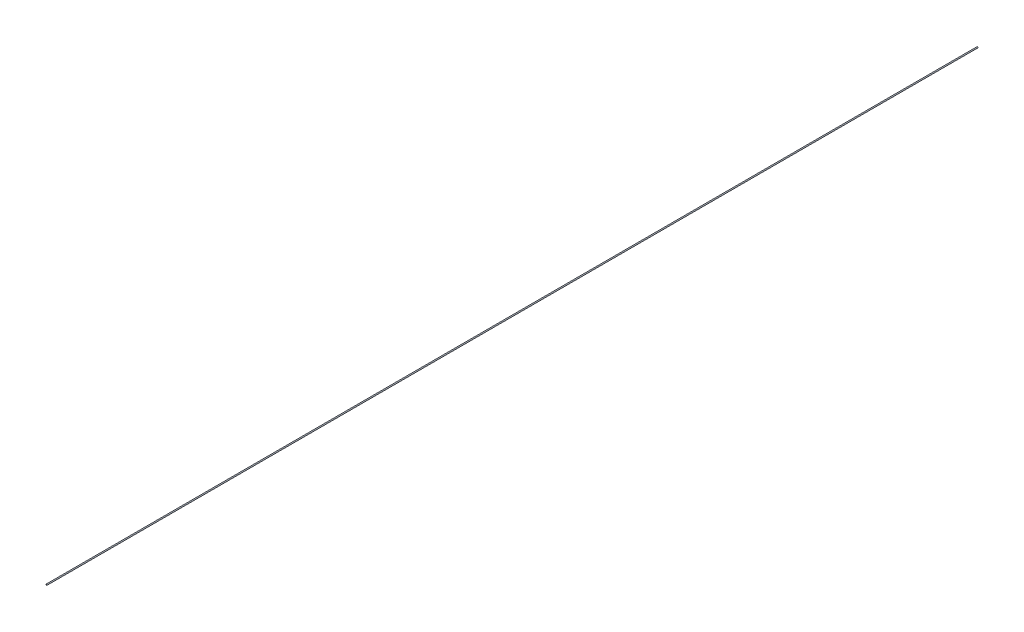
ISO-10303-21;
HEADER;
FILE_DESCRIPTION(('STEP AP214'),'2;1');
FILE_NAME('part.step','',(''),(''),'','','');
FILE_SCHEMA(('AUTOMOTIVE_DESIGN { 1 0 10303 214 1 1 1 1 }'));
ENDSEC;
DATA;
#1=APPLICATION_CONTEXT('core data for automotive mechanical design processes');
#2=APPLICATION_PROTOCOL_DEFINITION('international standard','automotive_design',2000,#1);
#3=PRODUCT_CONTEXT('',#1,'mechanical');
#4=PRODUCT('Part','Part','',(#3));
#5=PRODUCT_RELATED_PRODUCT_CATEGORY('part','',(#4));
#6=PRODUCT_DEFINITION_FORMATION('','',#4);
#7=PRODUCT_DEFINITION_CONTEXT('part definition',#1,'design');
#8=PRODUCT_DEFINITION('design','',#6,#7);
#9=PRODUCT_DEFINITION_SHAPE('','',#8);
#10=(LENGTH_UNIT() NAMED_UNIT(*) SI_UNIT(.MILLI.,.METRE.));
#11=(NAMED_UNIT(*) PLANE_ANGLE_UNIT() SI_UNIT($,.RADIAN.));
#12=(NAMED_UNIT(*) SI_UNIT($,.STERADIAN.) SOLID_ANGLE_UNIT());
#13=UNCERTAINTY_MEASURE_WITH_UNIT(LENGTH_MEASURE(1.E-05),#10,'distance_accuracy_value','');
#14=(GEOMETRIC_REPRESENTATION_CONTEXT(3) GLOBAL_UNCERTAINTY_ASSIGNED_CONTEXT((#13)) GLOBAL_UNIT_ASSIGNED_CONTEXT((#10,
#11,#12)) REPRESENTATION_CONTEXT('',''));
#15=CARTESIAN_POINT('',(0.,0.,0.));
#16=DIRECTION('',(0.,0.,1.));
#17=DIRECTION('',(1.,0.,0.));
#18=AXIS2_PLACEMENT_3D('',#15,#16,#17);
#19=CARTESIAN_POINT('',(0.,0.,11125.2));
#20=DIRECTION('',(0.,0.,1.));
#21=DIRECTION('',(1.,0.,0.));
#22=AXIS2_PLACEMENT_3D('',#19,#20,#21);
#23=PLANE('',#22);
#24=CARTESIAN_POINT('',(0.,0.,11125.2));
#25=DIRECTION('',(0.,0.,1.));
#26=DIRECTION('',(1.,0.,0.));
#27=AXIS2_PLACEMENT_3D('',#24,#25,#26);
#28=CIRCLE('',#27,6.35);
#29=CARTESIAN_POINT('',(6.35,0.,11125.2));
#30=VERTEX_POINT('',#29);
#31=EDGE_CURVE('E10',#30,#30,#28,.T.);
#32=ORIENTED_EDGE('',*,*,#31,.T.);
#33=EDGE_LOOP('',(#32));
#34=FACE_BOUND('',#33,.T.);
#35=CARTESIAN_POINT('',(0.,0.,11125.2));
#36=DIRECTION('',(0.,0.,1.));
#37=DIRECTION('',(1.,0.,0.));
#38=AXIS2_PLACEMENT_3D('',#35,#36,#37);
#39=CIRCLE('',#38,5.334);
#40=CARTESIAN_POINT('',(5.334,0.,11125.2));
#41=VERTEX_POINT('',#40);
#42=EDGE_CURVE('E43',#41,#41,#39,.T.);
#43=ORIENTED_EDGE('',*,*,#42,.F.);
#44=EDGE_LOOP('',(#43));
#45=FACE_BOUND('',#44,.T.);
#46=ADVANCED_FACE('F32',(#34,#45),#23,.T.);
#47=CARTESIAN_POINT('',(0.,0.,0.));
#48=DIRECTION('',(0.,0.,1.));
#49=DIRECTION('',(1.,0.,0.));
#50=AXIS2_PLACEMENT_3D('',#47,#48,#49);
#51=PLANE('',#50);
#52=CARTESIAN_POINT('',(0.,0.,0.));
#53=DIRECTION('',(0.,0.,1.));
#54=DIRECTION('',(1.,0.,0.));
#55=AXIS2_PLACEMENT_3D('',#52,#53,#54);
#56=CIRCLE('',#55,6.35);
#57=CARTESIAN_POINT('',(6.35,0.,0.));
#58=VERTEX_POINT('',#57);
#59=EDGE_CURVE('E36',#58,#58,#56,.T.);
#60=ORIENTED_EDGE('',*,*,#59,.F.);
#61=EDGE_LOOP('',(#60));
#62=FACE_BOUND('',#61,.T.);
#63=CARTESIAN_POINT('',(0.,0.,0.));
#64=DIRECTION('',(0.,0.,1.));
#65=DIRECTION('',(1.,0.,0.));
#66=AXIS2_PLACEMENT_3D('',#63,#64,#65);
#67=CIRCLE('',#66,5.334);
#68=CARTESIAN_POINT('',(5.334,0.,0.));
#69=VERTEX_POINT('',#68);
#70=EDGE_CURVE('E45',#69,#69,#67,.T.);
#71=ORIENTED_EDGE('',*,*,#70,.T.);
#72=EDGE_LOOP('',(#71));
#73=FACE_BOUND('',#72,.T.);
#74=ADVANCED_FACE('F55',(#62,#73),#51,.F.);
#75=CARTESIAN_POINT('',(0.,0.,11125.2));
#76=DIRECTION('',(0.,0.,-1.));
#77=DIRECTION('',(-1.,0.,0.));
#78=AXIS2_PLACEMENT_3D('',#75,#76,#77);
#79=CYLINDRICAL_SURFACE('',#78,6.35);
#80=ORIENTED_EDGE('',*,*,#31,.F.);
#81=EDGE_LOOP('',(#80));
#82=FACE_BOUND('',#81,.T.);
#83=ORIENTED_EDGE('',*,*,#59,.T.);
#84=EDGE_LOOP('',(#83));
#85=FACE_BOUND('',#84,.T.);
#86=ADVANCED_FACE('F34',(#82,#85),#79,.T.);
#87=CARTESIAN_POINT('',(0.,0.,11125.2));
#88=DIRECTION('',(0.,0.,-1.));
#89=DIRECTION('',(-1.,0.,0.));
#90=AXIS2_PLACEMENT_3D('',#87,#88,#89);
#91=CYLINDRICAL_SURFACE('',#90,5.334);
#92=ORIENTED_EDGE('',*,*,#42,.T.);
#93=EDGE_LOOP('',(#92));
#94=FACE_BOUND('',#93,.T.);
#95=ORIENTED_EDGE('',*,*,#70,.F.);
#96=EDGE_LOOP('',(#95));
#97=FACE_BOUND('',#96,.T.);
#98=ADVANCED_FACE('F51',(#94,#97),#91,.F.);
#99=CLOSED_SHELL('',(#46,#74,#86,#98));
#100=MANIFOLD_SOLID_BREP('B2',#99);
#101=ADVANCED_BREP_SHAPE_REPRESENTATION('',(#18,#100),#14);
#102=SHAPE_DEFINITION_REPRESENTATION(#9,#101);
ENDSEC;
END-ISO-10303-21;
